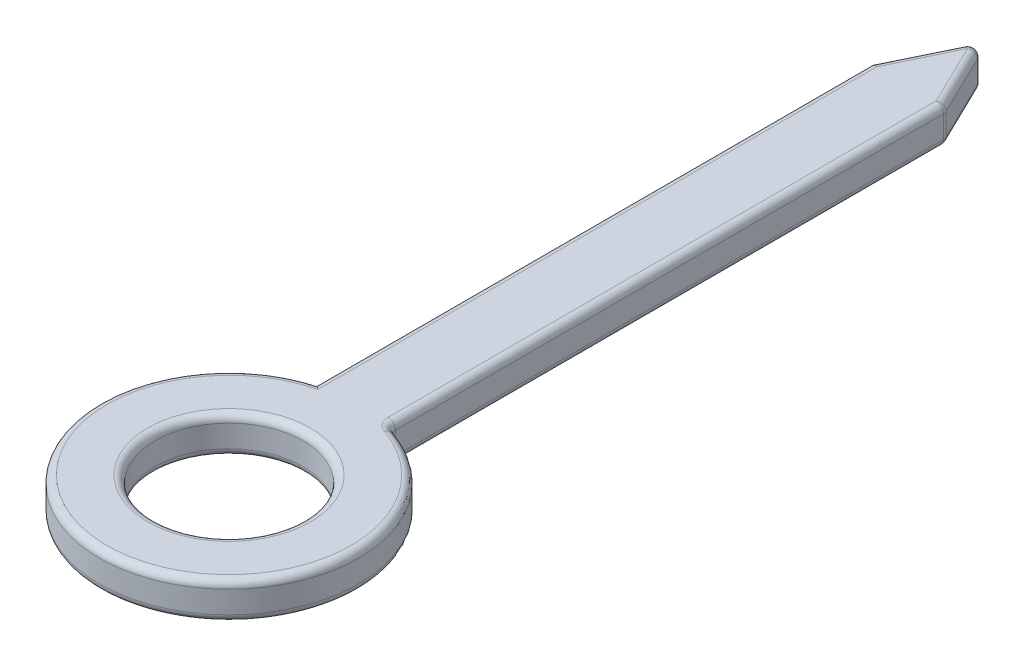
ISO-10303-21;
HEADER;
FILE_DESCRIPTION(('STEP AP214'),'2;1');
FILE_NAME('part.step','',(''),(''),'','','');
FILE_SCHEMA(('AUTOMOTIVE_DESIGN { 1 0 10303 214 1 1 1 1 }'));
ENDSEC;
DATA;
#1=APPLICATION_CONTEXT('core data for automotive mechanical design processes');
#2=APPLICATION_PROTOCOL_DEFINITION('international standard','automotive_design',2000,#1);
#3=PRODUCT_CONTEXT('',#1,'mechanical');
#4=PRODUCT('Part','Part','',(#3));
#5=PRODUCT_RELATED_PRODUCT_CATEGORY('part','',(#4));
#6=PRODUCT_DEFINITION_FORMATION('','',#4);
#7=PRODUCT_DEFINITION_CONTEXT('part definition',#1,'design');
#8=PRODUCT_DEFINITION('design','',#6,#7);
#9=PRODUCT_DEFINITION_SHAPE('','',#8);
#10=(LENGTH_UNIT() NAMED_UNIT(*) SI_UNIT(.MILLI.,.METRE.));
#11=(NAMED_UNIT(*) PLANE_ANGLE_UNIT() SI_UNIT($,.RADIAN.));
#12=(NAMED_UNIT(*) SI_UNIT($,.STERADIAN.) SOLID_ANGLE_UNIT());
#13=UNCERTAINTY_MEASURE_WITH_UNIT(LENGTH_MEASURE(1.E-05),#10,'distance_accuracy_value','');
#14=(GEOMETRIC_REPRESENTATION_CONTEXT(3) GLOBAL_UNCERTAINTY_ASSIGNED_CONTEXT((#13)) GLOBAL_UNIT_ASSIGNED_CONTEXT((#10,
#11,#12)) REPRESENTATION_CONTEXT('',''));
#15=CARTESIAN_POINT('',(0.,0.,0.));
#16=DIRECTION('',(0.,0.,1.));
#17=DIRECTION('',(1.,0.,0.));
#18=AXIS2_PLACEMENT_3D('',#15,#16,#17);
#19=CARTESIAN_POINT('',(0.,0.127,0.));
#20=DIRECTION('',(0.,1.,0.));
#21=DIRECTION('',(0.,0.,1.));
#22=AXIS2_PLACEMENT_3D('',#19,#20,#21);
#23=PLANE('',#22);
#24=CARTESIAN_POINT('',(0.,0.127,0.));
#25=DIRECTION('',(0.,1.,0.));
#26=DIRECTION('',(0.,0.,1.));
#27=AXIS2_PLACEMENT_3D('',#24,#25,#26);
#28=CIRCLE('',#27,0.279400000000001);
#29=CARTESIAN_POINT('',(0.,0.127,0.279400000000001));
#30=VERTEX_POINT('',#29);
#31=EDGE_CURVE('E409',#30,#30,#28,.F.);
#32=ORIENTED_EDGE('',*,*,#31,.T.);
#33=EDGE_LOOP('',(#32));
#34=FACE_BOUND('',#33,.T.);
#35=DIRECTION('',(-0.436508442838982,0.,0.899700160792632));
#36=VECTOR('',#35,1.);
#37=CARTESIAN_POINT('',(-0.104147615915867,0.127,-2.3198836352656));
#38=LINE('',#37,#36);
#39=CARTESIAN_POINT('',(0.,0.127,-2.53454529490328));
#40=VERTEX_POINT('',#39);
#41=CARTESIAN_POINT('',(-0.1016,0.127,-2.32513460002183));
#42=VERTEX_POINT('',#41);
#43=EDGE_CURVE('E303',#40,#42,#38,.T.);
#44=ORIENTED_EDGE('',*,*,#43,.T.);
#45=DIRECTION('',(0.,0.,1.));
#46=VECTOR('',#45,1.);
#47=CARTESIAN_POINT('',(-0.1016,0.127,-0.42597094971371));
#48=LINE('',#47,#46);
#49=CARTESIAN_POINT('',(-0.1016,0.127,-0.406598389076986));
#50=VERTEX_POINT('',#49);
#51=EDGE_CURVE('E404',#42,#50,#48,.T.);
#52=ORIENTED_EDGE('',*,*,#51,.T.);
#53=CARTESIAN_POINT('',(0.,0.127,0.));
#54=DIRECTION('',(0.,1.,0.));
#55=DIRECTION('',(0.,0.,1.));
#56=AXIS2_PLACEMENT_3D('',#53,#54,#55);
#57=CIRCLE('',#56,0.4191);
#58=CARTESIAN_POINT('',(0.135924324324324,0.127,-0.396445945945946));
#59=VERTEX_POINT('',#58);
#60=EDGE_CURVE('E142',#50,#59,#57,.T.);
#61=ORIENTED_EDGE('',*,*,#60,.T.);
#62=CARTESIAN_POINT('',(0.1524,0.127,-0.4445));
#63=DIRECTION('',(0.,1.,0.));
#64=DIRECTION('',(0.,0.,1.));
#65=AXIS2_PLACEMENT_3D('',#62,#63,#64);
#66=CIRCLE('',#65,0.0508);
#67=CARTESIAN_POINT('',(0.1016,0.127,-0.4445));
#68=VERTEX_POINT('',#67);
#69=EDGE_CURVE('E136',#68,#59,#66,.T.);
#70=ORIENTED_EDGE('',*,*,#69,.F.);
#71=DIRECTION('',(0.,0.,-1.));
#72=VECTOR('',#71,1.);
#73=CARTESIAN_POINT('',(0.1016,0.127,-2.33097094971371));
#74=LINE('',#73,#72);
#75=CARTESIAN_POINT('',(0.1016,0.127,-2.32513460002183));
#76=VERTEX_POINT('',#75);
#77=EDGE_CURVE('E138',#68,#76,#74,.T.);
#78=ORIENTED_EDGE('',*,*,#77,.T.);
#79=DIRECTION('',(-0.436508442838982,0.,-0.899700160792632));
#80=VECTOR('',#79,1.);
#81=CARTESIAN_POINT('',(-0.0228523840841328,0.127,-2.58164700386741));
#82=LINE('',#81,#80);
#83=EDGE_CURVE('E401',#76,#40,#82,.T.);
#84=ORIENTED_EDGE('',*,*,#83,.T.);
#85=EDGE_LOOP('',(#44,#52,#61,#70,#78,#84));
#86=FACE_BOUND('',#85,.T.);
#87=ADVANCED_FACE('F32',(#34,#86),#23,.T.);
#88=CARTESIAN_POINT('',(0.,0.,0.));
#89=DIRECTION('',(0.,1.,0.));
#90=DIRECTION('',(0.,0.,1.));
#91=AXIS2_PLACEMENT_3D('',#88,#89,#90);
#92=PLANE('',#91);
#93=CARTESIAN_POINT('',(0.,0.,0.));
#94=DIRECTION('',(0.,1.,0.));
#95=DIRECTION('',(0.,0.,1.));
#96=AXIS2_PLACEMENT_3D('',#93,#94,#95);
#97=CIRCLE('',#96,0.279400000000001);
#98=CARTESIAN_POINT('',(0.,0.,0.279400000000001));
#99=VERTEX_POINT('',#98);
#100=EDGE_CURVE('E11',#99,#99,#97,.T.);
#101=ORIENTED_EDGE('',*,*,#100,.T.);
#102=EDGE_LOOP('',(#101));
#103=FACE_BOUND('',#102,.T.);
#104=DIRECTION('',(-0.436508442838982,0.,-0.899700160792632));
#105=VECTOR('',#104,1.);
#106=CARTESIAN_POINT('',(0.995383650751788,0.,-0.482931299061075));
#107=LINE('',#106,#105);
#108=CARTESIAN_POINT('',(0.,0.,-2.53454529490328));
#109=VERTEX_POINT('',#108);
#110=CARTESIAN_POINT('',(0.1016,0.,-2.32513460002183));
#111=VERTEX_POINT('',#110);
#112=EDGE_CURVE('E57',#109,#111,#107,.F.);
#113=ORIENTED_EDGE('',*,*,#112,.T.);
#114=DIRECTION('',(0.,0.,-1.));
#115=VECTOR('',#114,1.);
#116=CARTESIAN_POINT('',(0.1016,0.,0.));
#117=LINE('',#116,#115);
#118=CARTESIAN_POINT('',(0.1016,0.,-0.4445));
#119=VERTEX_POINT('',#118);
#120=EDGE_CURVE('E41',#111,#119,#117,.F.);
#121=ORIENTED_EDGE('',*,*,#120,.T.);
#122=CARTESIAN_POINT('',(0.1524,0.,-0.4445));
#123=DIRECTION('',(0.,1.,0.));
#124=DIRECTION('',(0.,0.,1.));
#125=AXIS2_PLACEMENT_3D('',#122,#123,#124);
#126=CIRCLE('',#125,0.0508);
#127=CARTESIAN_POINT('',(0.135924324324324,0.,-0.396445945945946));
#128=VERTEX_POINT('',#127);
#129=EDGE_CURVE('E49',#128,#119,#126,.F.);
#130=ORIENTED_EDGE('',*,*,#129,.F.);
#131=CARTESIAN_POINT('',(0.,0.,0.));
#132=DIRECTION('',(0.,1.,0.));
#133=DIRECTION('',(0.,0.,1.));
#134=AXIS2_PLACEMENT_3D('',#131,#132,#133);
#135=CIRCLE('',#134,0.4191);
#136=CARTESIAN_POINT('',(-0.1016,0.,-0.406598389076986));
#137=VERTEX_POINT('',#136);
#138=EDGE_CURVE('E354',#128,#137,#135,.F.);
#139=ORIENTED_EDGE('',*,*,#138,.T.);
#140=DIRECTION('',(0.,0.,1.));
#141=VECTOR('',#140,1.);
#142=CARTESIAN_POINT('',(-0.1016,0.,0.));
#143=LINE('',#142,#141);
#144=CARTESIAN_POINT('',(-0.1016,0.,-2.32513460002183));
#145=VERTEX_POINT('',#144);
#146=EDGE_CURVE('E356',#137,#145,#143,.F.);
#147=ORIENTED_EDGE('',*,*,#146,.T.);
#148=DIRECTION('',(-0.436508442838982,0.,0.899700160792632));
#149=VECTOR('',#148,1.);
#150=CARTESIAN_POINT('',(-0.995383650751789,0.,-0.482931299061076));
#151=LINE('',#150,#149);
#152=EDGE_CURVE('E358',#145,#109,#151,.F.);
#153=ORIENTED_EDGE('',*,*,#152,.T.);
#154=EDGE_LOOP('',(#113,#121,#130,#139,#147,#153));
#155=FACE_BOUND('',#154,.T.);
#156=ADVANCED_FACE('F248',(#103,#155),#92,.F.);
#157=CARTESIAN_POINT('',(0.,0.127,0.));
#158=DIRECTION('',(0.,-1.,0.));
#159=DIRECTION('',(0.,0.,-1.));
#160=AXIS2_PLACEMENT_3D('',#157,#158,#159);
#161=CYLINDRICAL_SURFACE('',#160,0.4445);
#162=DIRECTION('',(0.,-1.,0.));
#163=VECTOR('',#162,1.);
#164=CARTESIAN_POINT('',(0.144162162162162,0.127,-0.420472972972973));
#165=LINE('',#164,#163);
#166=CARTESIAN_POINT('',(0.144162162162162,0.0254,-0.420472972972973));
#167=VERTEX_POINT('',#166);
#168=CARTESIAN_POINT('',(0.144162162162162,0.1016,-0.420472972972973));
#169=VERTEX_POINT('',#168);
#170=EDGE_CURVE('E335',#167,#169,#165,.F.);
#171=ORIENTED_EDGE('',*,*,#170,.T.);
#172=CARTESIAN_POINT('',(0.,0.1016,0.));
#173=DIRECTION('',(0.,1.,0.));
#174=DIRECTION('',(0.,0.,1.));
#175=AXIS2_PLACEMENT_3D('',#172,#173,#174);
#176=CIRCLE('',#175,0.4445);
#177=CARTESIAN_POINT('',(-0.127,0.1016,-0.42597094971371));
#178=VERTEX_POINT('',#177);
#179=EDGE_CURVE('E337',#169,#178,#176,.F.);
#180=ORIENTED_EDGE('',*,*,#179,.T.);
#181=DIRECTION('',(0.,-1.,0.));
#182=VECTOR('',#181,1.);
#183=CARTESIAN_POINT('',(-0.127,0.127,-0.42597094971371));
#184=LINE('',#183,#182);
#185=CARTESIAN_POINT('',(-0.127,0.0254,-0.42597094971371));
#186=VERTEX_POINT('',#185);
#187=EDGE_CURVE('E378',#178,#186,#184,.T.);
#188=ORIENTED_EDGE('',*,*,#187,.T.);
#189=CARTESIAN_POINT('',(0.,0.0254,0.));
#190=DIRECTION('',(0.,1.,0.));
#191=DIRECTION('',(0.,0.,1.));
#192=AXIS2_PLACEMENT_3D('',#189,#190,#191);
#193=CIRCLE('',#192,0.4445);
#194=EDGE_CURVE('E333',#186,#167,#193,.T.);
#195=ORIENTED_EDGE('',*,*,#194,.T.);
#196=EDGE_LOOP('',(#171,#180,#188,#195));
#197=FACE_BOUND('',#196,.T.);
#198=ADVANCED_FACE('F254',(#197),#161,.T.);
#199=CARTESIAN_POINT('',(0.127,0.127,-0.42597094971371));
#200=DIRECTION('',(-1.,0.,0.));
#201=DIRECTION('',(0.,0.,1.));
#202=AXIS2_PLACEMENT_3D('',#199,#200,#201);
#203=PLANE('',#202);
#204=DIRECTION('',(0.,0.,-1.));
#205=VECTOR('',#204,1.);
#206=CARTESIAN_POINT('',(0.127,0.1016,-0.42597094971371));
#207=LINE('',#206,#205);
#208=CARTESIAN_POINT('',(0.127,0.1016,-2.32513460002183));
#209=VERTEX_POINT('',#208);
#210=CARTESIAN_POINT('',(0.127,0.1016,-0.4445));
#211=VERTEX_POINT('',#210);
#212=EDGE_CURVE('E349',#209,#211,#207,.F.);
#213=ORIENTED_EDGE('',*,*,#212,.T.);
#214=DIRECTION('',(0.,1.,0.));
#215=VECTOR('',#214,1.);
#216=CARTESIAN_POINT('',(0.127,0.,-0.4445));
#217=LINE('',#216,#215);
#218=CARTESIAN_POINT('',(0.127,0.0254,-0.4445));
#219=VERTEX_POINT('',#218);
#220=EDGE_CURVE('E351',#211,#219,#217,.F.);
#221=ORIENTED_EDGE('',*,*,#220,.T.);
#222=DIRECTION('',(0.,0.,-1.));
#223=VECTOR('',#222,1.);
#224=CARTESIAN_POINT('',(0.127,0.0254,-0.42597094971371));
#225=LINE('',#224,#223);
#226=CARTESIAN_POINT('',(0.127,0.0254,-2.32513460002183));
#227=VERTEX_POINT('',#226);
#228=EDGE_CURVE('E345',#219,#227,#225,.T.);
#229=ORIENTED_EDGE('',*,*,#228,.T.);
#230=DIRECTION('',(0.,-1.,0.));
#231=VECTOR('',#230,1.);
#232=CARTESIAN_POINT('',(0.127,0.127,-2.32513460002183));
#233=LINE('',#232,#231);
#234=EDGE_CURVE('E347',#227,#209,#233,.F.);
#235=ORIENTED_EDGE('',*,*,#234,.T.);
#236=EDGE_LOOP('',(#213,#221,#229,#235));
#237=FACE_BOUND('',#236,.T.);
#238=ADVANCED_FACE('F271',(#237),#203,.F.);
#239=CARTESIAN_POINT('',(0.,0.127,-2.59273431831552));
#240=DIRECTION('',(-0.899700160792632,0.,0.436508442838982));
#241=DIRECTION('',(0.436508442838982,0.,0.899700160792632));
#242=AXIS2_PLACEMENT_3D('',#239,#240,#241);
#243=PLANE('',#242);
#244=DIRECTION('',(0.,-1.,0.));
#245=VECTOR('',#244,1.);
#246=CARTESIAN_POINT('',(0.0228523840841329,0.127,-2.54563260935139));
#247=LINE('',#246,#245);
#248=CARTESIAN_POINT('',(0.0228523840841329,0.0254,-2.54563260935139));
#249=VERTEX_POINT('',#248);
#250=CARTESIAN_POINT('',(0.0228523840841329,0.1016,-2.54563260935139));
#251=VERTEX_POINT('',#250);
#252=EDGE_CURVE('E312',#249,#251,#247,.F.);
#253=ORIENTED_EDGE('',*,*,#252,.T.);
#254=DIRECTION('',(-0.436508442838982,0.,-0.899700160792632));
#255=VECTOR('',#254,1.);
#256=CARTESIAN_POINT('',(0.127,0.1016,-2.33097094971371));
#257=LINE('',#256,#255);
#258=CARTESIAN_POINT('',(0.124452384084133,0.1016,-2.33622191446994));
#259=VERTEX_POINT('',#258);
#260=EDGE_CURVE('E330',#251,#259,#257,.F.);
#261=ORIENTED_EDGE('',*,*,#260,.T.);
#262=DIRECTION('',(0.,-1.,0.));
#263=VECTOR('',#262,1.);
#264=CARTESIAN_POINT('',(0.124452384084133,0.127,-2.33622191446994));
#265=LINE('',#264,#263);
#266=CARTESIAN_POINT('',(0.124452384084133,0.0254,-2.33622191446994));
#267=VERTEX_POINT('',#266);
#268=EDGE_CURVE('E328',#259,#267,#265,.T.);
#269=ORIENTED_EDGE('',*,*,#268,.T.);
#270=DIRECTION('',(-0.436508442838982,0.,-0.899700160792632));
#271=VECTOR('',#270,1.);
#272=CARTESIAN_POINT('',(0.,0.0254,-2.59273431831552));
#273=LINE('',#272,#271);
#274=EDGE_CURVE('E326',#267,#249,#273,.T.);
#275=ORIENTED_EDGE('',*,*,#274,.T.);
#276=EDGE_LOOP('',(#253,#261,#269,#275));
#277=FACE_BOUND('',#276,.T.);
#278=ADVANCED_FACE('F267',(#277),#243,.F.);
#279=CARTESIAN_POINT('',(-0.127,0.127,-2.33097094971371));
#280=DIRECTION('',(0.899700160792632,0.,0.436508442838982));
#281=DIRECTION('',(0.436508442838982,0.,-0.899700160792632));
#282=AXIS2_PLACEMENT_3D('',#279,#280,#281);
#283=PLANE('',#282);
#284=DIRECTION('',(0.,-1.,0.));
#285=VECTOR('',#284,1.);
#286=CARTESIAN_POINT('',(-0.127,0.127,-2.33097094971371));
#287=LINE('',#286,#285);
#288=CARTESIAN_POINT('',(-0.127,0.1016,-2.33097094971371));
#289=VERTEX_POINT('',#288);
#290=CARTESIAN_POINT('',(-0.127,0.0254,-2.33097094971371));
#291=VERTEX_POINT('',#290);
#292=EDGE_CURVE('E157',#289,#291,#287,.T.);
#293=ORIENTED_EDGE('',*,*,#292,.F.);
#294=DIRECTION('',(-0.436508442838982,0.,0.899700160792632));
#295=VECTOR('',#294,1.);
#296=CARTESIAN_POINT('',(0.,0.1016,-2.59273431831552));
#297=LINE('',#296,#295);
#298=CARTESIAN_POINT('',(-0.0228523840841329,0.1016,-2.54563260935139));
#299=VERTEX_POINT('',#298);
#300=EDGE_CURVE('E301',#289,#299,#297,.F.);
#301=ORIENTED_EDGE('',*,*,#300,.T.);
#302=DIRECTION('',(0.,-1.,0.));
#303=VECTOR('',#302,1.);
#304=CARTESIAN_POINT('',(-0.0228523840841329,0.127,-2.54563260935139));
#305=LINE('',#304,#303);
#306=CARTESIAN_POINT('',(-0.0228523840841329,0.0254,-2.54563260935139));
#307=VERTEX_POINT('',#306);
#308=EDGE_CURVE('E313',#299,#307,#305,.T.);
#309=ORIENTED_EDGE('',*,*,#308,.T.);
#310=DIRECTION('',(-0.436508442838982,0.,0.899700160792632));
#311=VECTOR('',#310,1.);
#312=CARTESIAN_POINT('',(-0.127,0.0254,-2.33097094971371));
#313=LINE('',#312,#311);
#314=EDGE_CURVE('E316',#307,#291,#313,.T.);
#315=ORIENTED_EDGE('',*,*,#314,.T.);
#316=EDGE_LOOP('',(#293,#301,#309,#315));
#317=FACE_BOUND('',#316,.T.);
#318=ADVANCED_FACE('F263',(#317),#283,.F.);
#319=CARTESIAN_POINT('',(-0.127,0.127,-0.42597094971371));
#320=DIRECTION('',(1.,0.,0.));
#321=DIRECTION('',(0.,0.,-1.));
#322=AXIS2_PLACEMENT_3D('',#319,#320,#321);
#323=PLANE('',#322);
#324=ORIENTED_EDGE('',*,*,#187,.F.);
#325=DIRECTION('',(0.,0.,1.));
#326=VECTOR('',#325,1.);
#327=CARTESIAN_POINT('',(-0.127,0.1016,-2.33097094971371));
#328=LINE('',#327,#326);
#329=EDGE_CURVE('E317',#178,#289,#328,.F.);
#330=ORIENTED_EDGE('',*,*,#329,.T.);
#331=ORIENTED_EDGE('',*,*,#292,.T.);
#332=DIRECTION('',(0.,0.,1.));
#333=VECTOR('',#332,1.);
#334=CARTESIAN_POINT('',(-0.127,0.0254,-0.42597094971371));
#335=LINE('',#334,#333);
#336=EDGE_CURVE('E320',#291,#186,#335,.T.);
#337=ORIENTED_EDGE('',*,*,#336,.T.);
#338=EDGE_LOOP('',(#324,#330,#331,#337));
#339=FACE_BOUND('',#338,.T.);
#340=ADVANCED_FACE('F260',(#339),#323,.F.);
#341=CARTESIAN_POINT('',(0.,0.127,0.));
#342=DIRECTION('',(0.,-1.,0.));
#343=DIRECTION('',(0.,0.,-1.));
#344=AXIS2_PLACEMENT_3D('',#341,#342,#343);
#345=CYLINDRICAL_SURFACE('',#344,0.254000000000001);
#346=CARTESIAN_POINT('',(0.,0.1016,0.));
#347=DIRECTION('',(0.,1.,0.));
#348=DIRECTION('',(0.,0.,1.));
#349=AXIS2_PLACEMENT_3D('',#346,#347,#348);
#350=CIRCLE('',#349,0.254000000000001);
#351=CARTESIAN_POINT('',(0.,0.1016,0.254000000000001));
#352=VERTEX_POINT('',#351);
#353=EDGE_CURVE('E342',#352,#352,#350,.T.);
#354=ORIENTED_EDGE('',*,*,#353,.T.);
#355=EDGE_LOOP('',(#354));
#356=FACE_BOUND('',#355,.T.);
#357=CARTESIAN_POINT('',(0.,0.0254,0.));
#358=DIRECTION('',(0.,1.,0.));
#359=DIRECTION('',(0.,0.,1.));
#360=AXIS2_PLACEMENT_3D('',#357,#358,#359);
#361=CIRCLE('',#360,0.254000000000001);
#362=CARTESIAN_POINT('',(0.,0.0254,0.254000000000001));
#363=VERTEX_POINT('',#362);
#364=EDGE_CURVE('E339',#363,#363,#361,.F.);
#365=ORIENTED_EDGE('',*,*,#364,.T.);
#366=EDGE_LOOP('',(#365));
#367=FACE_BOUND('',#366,.T.);
#368=ADVANCED_FACE('F231',(#356,#367),#345,.F.);
#369=CARTESIAN_POINT('',(0.1016,0.0254,-2.32513460002183));
#370=DIRECTION('',(0.,0.,1.));
#371=DIRECTION('',(1.,0.,0.));
#372=AXIS2_PLACEMENT_3D('',#369,#370,#371);
#373=SPHERICAL_SURFACE('',#372,0.0254);
#374=CARTESIAN_POINT('',(0.1016,0.0254,-2.32513460002183));
#375=DIRECTION('',(0.,0.,-1.));
#376=DIRECTION('',(-1.,0.,0.));
#377=AXIS2_PLACEMENT_3D('',#374,#375,#376);
#378=CIRCLE('',#377,0.0254);
#379=EDGE_CURVE('E202',#111,#227,#378,.F.);
#380=ORIENTED_EDGE('',*,*,#379,.F.);
#381=CARTESIAN_POINT('',(0.1016,0.0254,-2.32513460002183));
#382=DIRECTION('',(0.436508442838984,0.,0.89970016079263));
#383=DIRECTION('',(0.899700160792631,0.,-0.436508442838985));
#384=AXIS2_PLACEMENT_3D('',#381,#382,#383);
#385=CIRCLE('',#384,0.0254);
#386=EDGE_CURVE('E386',#267,#111,#385,.F.);
#387=ORIENTED_EDGE('',*,*,#386,.F.);
#388=CARTESIAN_POINT('',(0.1016,0.0254,-2.32513460002183));
#389=DIRECTION('',(0.,-1.,0.));
#390=DIRECTION('',(0.,0.,-1.));
#391=AXIS2_PLACEMENT_3D('',#388,#389,#390);
#392=CIRCLE('',#391,0.0254);
#393=EDGE_CURVE('E391',#227,#267,#392,.F.);
#394=ORIENTED_EDGE('',*,*,#393,.F.);
#395=EDGE_LOOP('',(#380,#387,#394));
#396=FACE_BOUND('',#395,.T.);
#397=ADVANCED_FACE('F229',(#396),#373,.T.);
#398=CARTESIAN_POINT('',(-0.1016,0.0254,-0.42597094971371));
#399=DIRECTION('',(0.,0.,1.));
#400=DIRECTION('',(1.,0.,0.));
#401=AXIS2_PLACEMENT_3D('',#398,#399,#400);
#402=CYLINDRICAL_SURFACE('',#401,0.0254);
#403=CARTESIAN_POINT('',(-0.127,0.0254,-0.42597094971371));
#404=CARTESIAN_POINT('',(-0.127001815650164,0.0241723426759314,-0.425972246953615));
#405=CARTESIAN_POINT('',(-0.126911126208679,0.0229466311873504,-0.425904707770792));
#406=CARTESIAN_POINT('',(-0.126559807885299,0.0205408086319512,-0.425642757901029));
#407=CARTESIAN_POINT('',(-0.126300174116844,0.019360473140223,-0.425449090129172));
#408=CARTESIAN_POINT('',(-0.125626229943669,0.017073681048908,-0.424945837648137));
#409=CARTESIAN_POINT('',(-0.125212150898122,0.0159671168478555,-0.424636426320897));
#410=CARTESIAN_POINT('',(-0.124250826191448,0.0138477228414693,-0.423917037481579));
#411=CARTESIAN_POINT('',(-0.123703411860809,0.0128350140212836,-0.423506932586527));
#412=CARTESIAN_POINT('',(-0.122457221036909,0.0108535464760911,-0.422571671685923));
#413=CARTESIAN_POINT('',(-0.121750644416042,0.00989255123083051,-0.422040558666878));
#414=CARTESIAN_POINT('',(-0.120238515971597,0.00810438432226379,-0.420901452206111));
#415=CARTESIAN_POINT('',(-0.119432945488039,0.00727723795726673,-0.420293444269347));
#416=CARTESIAN_POINT('',(-0.117586917135211,0.00561626796599521,-0.418896784098937));
#417=CARTESIAN_POINT('',(-0.116530769528652,0.00481041028148322,-0.418095658059797));
#418=CARTESIAN_POINT('',(-0.114342117522287,0.00338851778598622,-0.416430295138115));
#419=CARTESIAN_POINT('',(-0.113209510564827,0.00277274436483277,-0.415565973354458));
#420=CARTESIAN_POINT('',(-0.110500805453628,0.00154980755474742,-0.413492040171165));
#421=CARTESIAN_POINT('',(-0.108904688011649,0.00101654332078689,-0.412264825939465));
#422=CARTESIAN_POINT('',(-0.105673996988405,0.000274209720169538,-0.40976919400883));
#423=CARTESIAN_POINT('',(-0.104039480276605,6.46882590985581E-05,-0.408500836298671));
#424=CARTESIAN_POINT('',(-0.10213778877286,4.27004736220308E-06,-0.407018170386568));
#425=CARTESIAN_POINT('',(-0.10186881981745,3.28772615383254E-09,-0.406808304025761));
#426=CARTESIAN_POINT('',(-0.1016,0.,-0.406598389076986));
#427=B_SPLINE_CURVE_WITH_KNOTS('',3,(#403,#404,#405,#406,#407,#408,#409,#410,#411,#412,#413,
#414,#415,#416,#417,#418,#419,#420,#421,#422,#423,#424,#425,#426),.UNSPECIFIED.,.F.,.F.,(4,2,2,
2,2,2,2,2,2,2,2,4),(0.,0.00367470297341455,0.00732795483412095,0.0109757559568155,
0.0146281957448195,0.0185308479552815,0.0224342369330154,0.027071291221027,0.0317146939263875,
0.0379345519872367,0.0441457163787246,0.0451691435625022),.UNSPECIFIED.);
#428=EDGE_CURVE('E194',#186,#137,#427,.T.);
#429=ORIENTED_EDGE('',*,*,#428,.F.);
#430=ORIENTED_EDGE('',*,*,#336,.F.);
#431=CARTESIAN_POINT('',(-0.101600000000001,0.0254,-2.32513460002183));
#432=DIRECTION('',(-0.22394177726294,0.,0.974602524312509));
#433=DIRECTION('',(0.974602524312509,0.,0.22394177726294));
#434=AXIS2_PLACEMENT_3D('',#431,#432,#433);
#435=ELLIPSE('',#434,0.0260619066402658,0.0254);
#436=EDGE_CURVE('E36',#145,#291,#435,.F.);
#437=ORIENTED_EDGE('',*,*,#436,.F.);
#438=ORIENTED_EDGE('',*,*,#146,.F.);
#439=EDGE_LOOP('',(#429,#430,#437,#438));
#440=FACE_BOUND('',#439,.T.);
#441=ADVANCED_FACE('F204',(#440),#402,.T.);
#442=CARTESIAN_POINT('',(-0.104147615915867,0.0254,-2.3198836352656));
#443=DIRECTION('',(-0.436508442838982,0.,0.899700160792632));
#444=DIRECTION('',(0.899700160792632,0.,0.436508442838982));
#445=AXIS2_PLACEMENT_3D('',#442,#443,#444);
#446=CYLINDRICAL_SURFACE('',#445,0.0254);
#447=ORIENTED_EDGE('',*,*,#436,.T.);
#448=ORIENTED_EDGE('',*,*,#314,.F.);
#449=CARTESIAN_POINT('',(0.,0.0254,-2.53454529490328));
#450=DIRECTION('',(0.436508442838984,0.,-0.899700160792631));
#451=DIRECTION('',(-0.899700160792631,0.,-0.436508442838984));
#452=AXIS2_PLACEMENT_3D('',#449,#450,#451);
#453=CIRCLE('',#452,0.0254);
#454=EDGE_CURVE('E191',#109,#307,#453,.T.);
#455=ORIENTED_EDGE('',*,*,#454,.F.);
#456=ORIENTED_EDGE('',*,*,#152,.F.);
#457=EDGE_LOOP('',(#447,#448,#455,#456));
#458=FACE_BOUND('',#457,.T.);
#459=ADVANCED_FACE('F224',(#458),#446,.T.);
#460=CARTESIAN_POINT('',(-0.0228523840841328,0.0254,-2.58164700386741));
#461=DIRECTION('',(-0.436508442838982,0.,-0.899700160792632));
#462=DIRECTION('',(-0.899700160792632,0.,0.436508442838982));
#463=AXIS2_PLACEMENT_3D('',#460,#461,#462);
#464=CYLINDRICAL_SURFACE('',#463,0.0254);
#465=ORIENTED_EDGE('',*,*,#386,.T.);
#466=ORIENTED_EDGE('',*,*,#112,.F.);
#467=CARTESIAN_POINT('',(0.,0.0254,-2.53454529490328));
#468=DIRECTION('',(-0.436508442838985,0.,-0.89970016079263));
#469=DIRECTION('',(-0.89970016079263,0.,0.436508442838985));
#470=AXIS2_PLACEMENT_3D('',#467,#468,#469);
#471=CIRCLE('',#470,0.0254);
#472=EDGE_CURVE('E188',#249,#109,#471,.T.);
#473=ORIENTED_EDGE('',*,*,#472,.F.);
#474=ORIENTED_EDGE('',*,*,#274,.F.);
#475=EDGE_LOOP('',(#465,#466,#473,#474));
#476=FACE_BOUND('',#475,.T.);
#477=ADVANCED_FACE('F220',(#476),#464,.T.);
#478=CARTESIAN_POINT('',(0.1016,0.127,-2.32513460002183));
#479=DIRECTION('',(0.,-1.,0.));
#480=DIRECTION('',(0.,0.,-1.));
#481=AXIS2_PLACEMENT_3D('',#478,#479,#480);
#482=CYLINDRICAL_SURFACE('',#481,0.0254);
#483=ORIENTED_EDGE('',*,*,#393,.T.);
#484=ORIENTED_EDGE('',*,*,#268,.F.);
#485=CARTESIAN_POINT('',(0.1016,0.1016,-2.32513460002183));
#486=DIRECTION('',(0.,1.,0.));
#487=DIRECTION('',(0.,0.,1.));
#488=AXIS2_PLACEMENT_3D('',#485,#486,#487);
#489=CIRCLE('',#488,0.0254);
#490=EDGE_CURVE('E185',#209,#259,#489,.T.);
#491=ORIENTED_EDGE('',*,*,#490,.F.);
#492=ORIENTED_EDGE('',*,*,#234,.F.);
#493=EDGE_LOOP('',(#483,#484,#491,#492));
#494=FACE_BOUND('',#493,.T.);
#495=ADVANCED_FACE('F216',(#494),#482,.T.);
#496=CARTESIAN_POINT('',(0.1016,0.0254,-0.42597094971371));
#497=DIRECTION('',(0.,0.,-1.));
#498=DIRECTION('',(-1.,0.,0.));
#499=AXIS2_PLACEMENT_3D('',#496,#497,#498);
#500=CYLINDRICAL_SURFACE('',#499,0.0254);
#501=ORIENTED_EDGE('',*,*,#379,.T.);
#502=ORIENTED_EDGE('',*,*,#228,.F.);
#503=CARTESIAN_POINT('',(0.1016,0.0254,-0.4445));
#504=DIRECTION('',(0.,0.,1.));
#505=DIRECTION('',(1.,0.,0.));
#506=AXIS2_PLACEMENT_3D('',#503,#504,#505);
#507=CIRCLE('',#506,0.0254);
#508=EDGE_CURVE('E183',#119,#219,#507,.T.);
#509=ORIENTED_EDGE('',*,*,#508,.F.);
#510=ORIENTED_EDGE('',*,*,#120,.F.);
#511=EDGE_LOOP('',(#501,#502,#509,#510));
#512=FACE_BOUND('',#511,.T.);
#513=ADVANCED_FACE('F212',(#512),#500,.T.);
#514=CARTESIAN_POINT('',(0.,0.0254,0.));
#515=DIRECTION('',(0.,1.,0.));
#516=DIRECTION('',(0.,0.,1.));
#517=AXIS2_PLACEMENT_3D('',#514,#515,#516);
#518=TOROIDAL_SURFACE('',#517,0.4191,0.0254);
#519=ORIENTED_EDGE('',*,*,#428,.T.);
#520=ORIENTED_EDGE('',*,*,#138,.F.);
#521=CARTESIAN_POINT('',(0.135924324324324,0.0254,-0.396445945945946));
#522=DIRECTION('',(-0.945945945945946,0.,-0.324324324324325));
#523=DIRECTION('',(-0.324324324324325,0.,0.945945945945946));
#524=AXIS2_PLACEMENT_3D('',#521,#522,#523);
#525=CIRCLE('',#524,0.0254);
#526=EDGE_CURVE('E181',#167,#128,#525,.T.);
#527=ORIENTED_EDGE('',*,*,#526,.F.);
#528=ORIENTED_EDGE('',*,*,#194,.F.);
#529=EDGE_LOOP('',(#519,#520,#527,#528));
#530=FACE_BOUND('',#529,.T.);
#531=ADVANCED_FACE('F207',(#530),#518,.T.);
#532=CARTESIAN_POINT('',(0.,0.0254,-2.53454529490328));
#533=DIRECTION('',(0.,0.,1.));
#534=DIRECTION('',(1.,0.,0.));
#535=AXIS2_PLACEMENT_3D('',#532,#533,#534);
#536=SPHERICAL_SURFACE('',#535,0.0254);
#537=ORIENTED_EDGE('',*,*,#472,.T.);
#538=ORIENTED_EDGE('',*,*,#454,.T.);
#539=CARTESIAN_POINT('',(0.,0.0254,-2.53454529490328));
#540=DIRECTION('',(0.,-1.,0.));
#541=DIRECTION('',(0.,0.,-1.));
#542=AXIS2_PLACEMENT_3D('',#539,#540,#541);
#543=CIRCLE('',#542,0.0254);
#544=EDGE_CURVE('E178',#249,#307,#543,.F.);
#545=ORIENTED_EDGE('',*,*,#544,.F.);
#546=EDGE_LOOP('',(#537,#538,#545));
#547=FACE_BOUND('',#546,.T.);
#548=ADVANCED_FACE('F211',(#547),#536,.T.);
#549=CARTESIAN_POINT('',(0.1016,0.1016,-2.32513460002183));
#550=DIRECTION('',(0.,0.,1.));
#551=DIRECTION('',(1.,0.,0.));
#552=AXIS2_PLACEMENT_3D('',#549,#550,#551);
#553=SPHERICAL_SURFACE('',#552,0.0254);
#554=CARTESIAN_POINT('',(0.1016,0.1016,-2.32513460002183));
#555=DIRECTION('',(0.,0.,-1.));
#556=DIRECTION('',(-1.,0.,0.));
#557=AXIS2_PLACEMENT_3D('',#554,#555,#556);
#558=CIRCLE('',#557,0.0254);
#559=EDGE_CURVE('E155',#209,#76,#558,.F.);
#560=ORIENTED_EDGE('',*,*,#559,.F.);
#561=ORIENTED_EDGE('',*,*,#490,.T.);
#562=CARTESIAN_POINT('',(0.1016,0.1016,-2.32513460002183));
#563=DIRECTION('',(0.436508442838985,0.,0.89970016079263));
#564=DIRECTION('',(0.89970016079263,0.,-0.436508442838985));
#565=AXIS2_PLACEMENT_3D('',#562,#563,#564);
#566=CIRCLE('',#565,0.0254);
#567=EDGE_CURVE('E176',#76,#259,#566,.F.);
#568=ORIENTED_EDGE('',*,*,#567,.F.);
#569=EDGE_LOOP('',(#560,#561,#568));
#570=FACE_BOUND('',#569,.T.);
#571=ADVANCED_FACE('F397',(#570),#553,.T.);
#572=CARTESIAN_POINT('',(0.1524,0.0254,-0.4445));
#573=DIRECTION('',(0.,1.,0.));
#574=DIRECTION('',(0.,0.,1.));
#575=AXIS2_PLACEMENT_3D('',#572,#573,#574);
#576=TOROIDAL_SURFACE('',#575,0.0508,0.0254);
#577=ORIENTED_EDGE('',*,*,#129,.T.);
#578=ORIENTED_EDGE('',*,*,#508,.T.);
#579=CARTESIAN_POINT('',(0.1524,0.0254,-0.4445));
#580=DIRECTION('',(0.,1.,0.));
#581=DIRECTION('',(0.,0.,1.));
#582=AXIS2_PLACEMENT_3D('',#579,#580,#581);
#583=CIRCLE('',#582,0.0254);
#584=EDGE_CURVE('E173',#167,#219,#583,.F.);
#585=ORIENTED_EDGE('',*,*,#584,.F.);
#586=ORIENTED_EDGE('',*,*,#526,.T.);
#587=EDGE_LOOP('',(#577,#578,#585,#586));
#588=FACE_BOUND('',#587,.T.);
#589=ADVANCED_FACE('F368',(#588),#576,.T.);
#590=CARTESIAN_POINT('',(0.,0.127,-2.53454529490328));
#591=DIRECTION('',(0.,-1.,0.));
#592=DIRECTION('',(0.,0.,-1.));
#593=AXIS2_PLACEMENT_3D('',#590,#591,#592);
#594=CYLINDRICAL_SURFACE('',#593,0.0254);
#595=ORIENTED_EDGE('',*,*,#544,.T.);
#596=ORIENTED_EDGE('',*,*,#308,.F.);
#597=CARTESIAN_POINT('',(0.,0.1016,-2.53454529490328));
#598=DIRECTION('',(0.,1.,0.));
#599=DIRECTION('',(0.,0.,1.));
#600=AXIS2_PLACEMENT_3D('',#597,#598,#599);
#601=CIRCLE('',#600,0.0254);
#602=EDGE_CURVE('E165',#251,#299,#601,.T.);
#603=ORIENTED_EDGE('',*,*,#602,.F.);
#604=ORIENTED_EDGE('',*,*,#252,.F.);
#605=EDGE_LOOP('',(#595,#596,#603,#604));
#606=FACE_BOUND('',#605,.T.);
#607=ADVANCED_FACE('F311',(#606),#594,.T.);
#608=CARTESIAN_POINT('',(0.995383650751788,0.1016,-0.482931299061075));
#609=DIRECTION('',(0.436508442838982,0.,0.899700160792632));
#610=DIRECTION('',(0.899700160792632,0.,-0.436508442838982));
#611=AXIS2_PLACEMENT_3D('',#608,#609,#610);
#612=CYLINDRICAL_SURFACE('',#611,0.0254);
#613=ORIENTED_EDGE('',*,*,#567,.T.);
#614=ORIENTED_EDGE('',*,*,#260,.F.);
#615=CARTESIAN_POINT('',(0.,0.1016,-2.53454529490328));
#616=DIRECTION('',(-0.436508442838985,0.,-0.89970016079263));
#617=DIRECTION('',(-0.89970016079263,0.,0.436508442838985));
#618=AXIS2_PLACEMENT_3D('',#615,#616,#617);
#619=CIRCLE('',#618,0.0254);
#620=EDGE_CURVE('E162',#40,#251,#619,.T.);
#621=ORIENTED_EDGE('',*,*,#620,.F.);
#622=ORIENTED_EDGE('',*,*,#83,.F.);
#623=EDGE_LOOP('',(#613,#614,#621,#622));
#624=FACE_BOUND('',#623,.T.);
#625=ADVANCED_FACE('F402',(#624),#612,.T.);
#626=CARTESIAN_POINT('',(0.1016,0.1016,0.));
#627=DIRECTION('',(0.,0.,1.));
#628=DIRECTION('',(1.,0.,0.));
#629=AXIS2_PLACEMENT_3D('',#626,#627,#628);
#630=CYLINDRICAL_SURFACE('',#629,0.0254);
#631=ORIENTED_EDGE('',*,*,#559,.T.);
#632=ORIENTED_EDGE('',*,*,#77,.F.);
#633=CARTESIAN_POINT('',(0.1016,0.1016,-0.4445));
#634=DIRECTION('',(0.,0.,1.));
#635=DIRECTION('',(1.,0.,0.));
#636=AXIS2_PLACEMENT_3D('',#633,#634,#635);
#637=CIRCLE('',#636,0.0254);
#638=EDGE_CURVE('E152',#211,#68,#637,.T.);
#639=ORIENTED_EDGE('',*,*,#638,.F.);
#640=ORIENTED_EDGE('',*,*,#212,.F.);
#641=EDGE_LOOP('',(#631,#632,#639,#640));
#642=FACE_BOUND('',#641,.T.);
#643=ADVANCED_FACE('F150',(#642),#630,.T.);
#644=CARTESIAN_POINT('',(0.1524,0.127,-0.4445));
#645=DIRECTION('',(0.,-1.,0.));
#646=DIRECTION('',(0.,0.,-1.));
#647=AXIS2_PLACEMENT_3D('',#644,#645,#646);
#648=CYLINDRICAL_SURFACE('',#647,0.0254);
#649=ORIENTED_EDGE('',*,*,#584,.T.);
#650=ORIENTED_EDGE('',*,*,#220,.F.);
#651=CARTESIAN_POINT('',(0.1524,0.1016,-0.4445));
#652=DIRECTION('',(0.,1.,0.));
#653=DIRECTION('',(0.,0.,1.));
#654=AXIS2_PLACEMENT_3D('',#651,#652,#653);
#655=CIRCLE('',#654,0.0254);
#656=EDGE_CURVE('E161',#169,#211,#655,.F.);
#657=ORIENTED_EDGE('',*,*,#656,.F.);
#658=ORIENTED_EDGE('',*,*,#170,.F.);
#659=EDGE_LOOP('',(#649,#650,#657,#658));
#660=FACE_BOUND('',#659,.T.);
#661=ADVANCED_FACE('F373',(#660),#648,.F.);
#662=CARTESIAN_POINT('',(0.,0.1016,-2.53454529490328));
#663=DIRECTION('',(0.,0.,1.));
#664=DIRECTION('',(1.,0.,0.));
#665=AXIS2_PLACEMENT_3D('',#662,#663,#664);
#666=SPHERICAL_SURFACE('',#665,0.0254);
#667=ORIENTED_EDGE('',*,*,#620,.T.);
#668=ORIENTED_EDGE('',*,*,#602,.T.);
#669=CARTESIAN_POINT('',(0.,0.1016,-2.53454529490328));
#670=DIRECTION('',(0.436508442838985,0.,-0.89970016079263));
#671=DIRECTION('',(-0.89970016079263,0.,-0.436508442838985));
#672=AXIS2_PLACEMENT_3D('',#669,#670,#671);
#673=CIRCLE('',#672,0.0254);
#674=EDGE_CURVE('E167',#40,#299,#673,.F.);
#675=ORIENTED_EDGE('',*,*,#674,.F.);
#676=EDGE_LOOP('',(#667,#668,#675));
#677=FACE_BOUND('',#676,.T.);
#678=ADVANCED_FACE('F305',(#677),#666,.T.);
#679=CARTESIAN_POINT('',(0.1524,0.1016,-0.4445));
#680=DIRECTION('',(0.,1.,0.));
#681=DIRECTION('',(0.,0.,1.));
#682=AXIS2_PLACEMENT_3D('',#679,#680,#681);
#683=TOROIDAL_SURFACE('',#682,0.0508,0.0254);
#684=ORIENTED_EDGE('',*,*,#638,.T.);
#685=ORIENTED_EDGE('',*,*,#69,.T.);
#686=CARTESIAN_POINT('',(0.135924324324324,0.1016,-0.396445945945946));
#687=DIRECTION('',(-0.945945945945946,0.,-0.324324324324325));
#688=DIRECTION('',(-0.324324324324325,0.,0.945945945945946));
#689=AXIS2_PLACEMENT_3D('',#686,#687,#688);
#690=CIRCLE('',#689,0.0254);
#691=EDGE_CURVE('E294',#169,#59,#690,.F.);
#692=ORIENTED_EDGE('',*,*,#691,.F.);
#693=ORIENTED_EDGE('',*,*,#656,.T.);
#694=EDGE_LOOP('',(#684,#685,#692,#693));
#695=FACE_BOUND('',#694,.T.);
#696=ADVANCED_FACE('F159',(#695),#683,.T.);
#697=CARTESIAN_POINT('',(-0.995383650751789,0.1016,-0.482931299061076));
#698=DIRECTION('',(0.436508442838982,0.,-0.899700160792632));
#699=DIRECTION('',(-0.899700160792632,0.,-0.436508442838982));
#700=AXIS2_PLACEMENT_3D('',#697,#698,#699);
#701=CYLINDRICAL_SURFACE('',#700,0.0254);
#702=ORIENTED_EDGE('',*,*,#674,.T.);
#703=ORIENTED_EDGE('',*,*,#300,.F.);
#704=CARTESIAN_POINT('',(-0.1016,0.1016,-2.32513460002183));
#705=DIRECTION('',(0.22394177726294,0.,-0.974602524312509));
#706=DIRECTION('',(0.974602524312509,0.,0.22394177726294));
#707=AXIS2_PLACEMENT_3D('',#704,#705,#706);
#708=ELLIPSE('',#707,0.0260619066402658,0.0254);
#709=EDGE_CURVE('E291',#42,#289,#708,.F.);
#710=ORIENTED_EDGE('',*,*,#709,.F.);
#711=ORIENTED_EDGE('',*,*,#43,.F.);
#712=EDGE_LOOP('',(#702,#703,#710,#711));
#713=FACE_BOUND('',#712,.T.);
#714=ADVANCED_FACE('F281',(#713),#701,.T.);
#715=CARTESIAN_POINT('',(0.,0.1016,0.));
#716=DIRECTION('',(0.,1.,0.));
#717=DIRECTION('',(0.,0.,1.));
#718=AXIS2_PLACEMENT_3D('',#715,#716,#717);
#719=TOROIDAL_SURFACE('',#718,0.4191,0.0254);
#720=ORIENTED_EDGE('',*,*,#691,.T.);
#721=ORIENTED_EDGE('',*,*,#60,.F.);
#722=CARTESIAN_POINT('',(-0.127,0.1016,-0.42597094971371));
#723=CARTESIAN_POINT('',(-0.127001815650164,0.102827657324069,-0.425972246953615));
#724=CARTESIAN_POINT('',(-0.126911126208679,0.10405336881265,-0.425904707770792));
#725=CARTESIAN_POINT('',(-0.126559807885299,0.106459191368049,-0.425642757901029));
#726=CARTESIAN_POINT('',(-0.126300174116844,0.107639526859777,-0.425449090129172));
#727=CARTESIAN_POINT('',(-0.125626229943669,0.109926318951092,-0.424945837648137));
#728=CARTESIAN_POINT('',(-0.125212150898122,0.111032883152144,-0.424636426320897));
#729=CARTESIAN_POINT('',(-0.124250826191448,0.113152277158531,-0.423917037481579));
#730=CARTESIAN_POINT('',(-0.123703411860809,0.114164985978716,-0.423506932586527));
#731=CARTESIAN_POINT('',(-0.122457221036909,0.116146453523909,-0.422571671685923));
#732=CARTESIAN_POINT('',(-0.121750644416042,0.117107448769169,-0.422040558666878));
#733=CARTESIAN_POINT('',(-0.120238515971597,0.118895615677736,-0.420901452206111));
#734=CARTESIAN_POINT('',(-0.119432945488039,0.119722762042733,-0.420293444269347));
#735=CARTESIAN_POINT('',(-0.117586917135211,0.121383732034005,-0.418896784098937));
#736=CARTESIAN_POINT('',(-0.116530769528652,0.122189589718517,-0.418095658059797));
#737=CARTESIAN_POINT('',(-0.114342117522287,0.123611482214014,-0.416430295138115));
#738=CARTESIAN_POINT('',(-0.113209510564827,0.124227255635167,-0.415565973354458));
#739=CARTESIAN_POINT('',(-0.110500805453628,0.125450192445253,-0.413492040171165));
#740=CARTESIAN_POINT('',(-0.108904688011649,0.125983456679213,-0.412264825939465));
#741=CARTESIAN_POINT('',(-0.105673996988405,0.12672579027983,-0.40976919400883));
#742=CARTESIAN_POINT('',(-0.104039480276605,0.126935311740901,-0.408500836298671));
#743=CARTESIAN_POINT('',(-0.10213778877286,0.126995729952638,-0.407018170386568));
#744=CARTESIAN_POINT('',(-0.10186881981745,0.126999996712274,-0.406808304025761));
#745=CARTESIAN_POINT('',(-0.1016,0.127,-0.406598389076986));
#746=B_SPLINE_CURVE_WITH_KNOTS('',3,(#722,#723,#724,#725,#726,#727,#728,#729,#730,#731,#732,
#733,#734,#735,#736,#737,#738,#739,#740,#741,#742,#743,#744,#745),.UNSPECIFIED.,.F.,.F.,(4,2,2,
2,2,2,2,2,2,2,2,4),(0.,0.00367470297341456,0.00732795483412096,0.0109757559568155,
0.0146281957448195,0.0185308479552816,0.0224342369330154,0.027071291221027,0.0317146939263875,
0.0379345519872367,0.0441457163787247,0.0451691435625022),.UNSPECIFIED.);
#747=EDGE_CURVE('E286',#178,#50,#746,.T.);
#748=ORIENTED_EDGE('',*,*,#747,.F.);
#749=ORIENTED_EDGE('',*,*,#179,.F.);
#750=EDGE_LOOP('',(#720,#721,#748,#749));
#751=FACE_BOUND('',#750,.T.);
#752=ADVANCED_FACE('F242',(#751),#719,.T.);
#753=CARTESIAN_POINT('',(-0.1016,0.1016,0.));
#754=DIRECTION('',(0.,0.,-1.));
#755=DIRECTION('',(-1.,0.,0.));
#756=AXIS2_PLACEMENT_3D('',#753,#754,#755);
#757=CYLINDRICAL_SURFACE('',#756,0.0254);
#758=ORIENTED_EDGE('',*,*,#709,.T.);
#759=ORIENTED_EDGE('',*,*,#329,.F.);
#760=ORIENTED_EDGE('',*,*,#747,.T.);
#761=ORIENTED_EDGE('',*,*,#51,.F.);
#762=EDGE_LOOP('',(#758,#759,#760,#761));
#763=FACE_BOUND('',#762,.T.);
#764=ADVANCED_FACE('F235',(#763),#757,.T.);
#765=CARTESIAN_POINT('',(0.,0.1016,0.));
#766=DIRECTION('',(0.,1.,0.));
#767=DIRECTION('',(0.,0.,1.));
#768=AXIS2_PLACEMENT_3D('',#765,#766,#767);
#769=TOROIDAL_SURFACE('',#768,0.279400000000001,0.0254);
#770=ORIENTED_EDGE('',*,*,#31,.F.);
#771=EDGE_LOOP('',(#770));
#772=FACE_BOUND('',#771,.T.);
#773=ORIENTED_EDGE('',*,*,#353,.F.);
#774=EDGE_LOOP('',(#773));
#775=FACE_BOUND('',#774,.T.);
#776=ADVANCED_FACE('F233',(#772,#775),#769,.T.);
#777=CARTESIAN_POINT('',(0.,0.0254,0.));
#778=DIRECTION('',(0.,1.,0.));
#779=DIRECTION('',(0.,0.,1.));
#780=AXIS2_PLACEMENT_3D('',#777,#778,#779);
#781=TOROIDAL_SURFACE('',#780,0.279400000000001,0.0254);
#782=ORIENTED_EDGE('',*,*,#364,.F.);
#783=EDGE_LOOP('',(#782));
#784=FACE_BOUND('',#783,.T.);
#785=ORIENTED_EDGE('',*,*,#100,.F.);
#786=EDGE_LOOP('',(#785));
#787=FACE_BOUND('',#786,.T.);
#788=ADVANCED_FACE('F34',(#784,#787),#781,.T.);
#789=CLOSED_SHELL('',(#87,#156,#198,#238,#278,#318,#340,#368,#397,#441,#459,#477,#495,#513,#531,
#548,#571,#589,#607,#625,#643,#661,#678,#696,#714,#752,#764,#776,#788));
#790=MANIFOLD_SOLID_BREP('B2',#789);
#791=ADVANCED_BREP_SHAPE_REPRESENTATION('',(#18,#790),#14);
#792=SHAPE_DEFINITION_REPRESENTATION(#9,#791);
ENDSEC;
END-ISO-10303-21;
